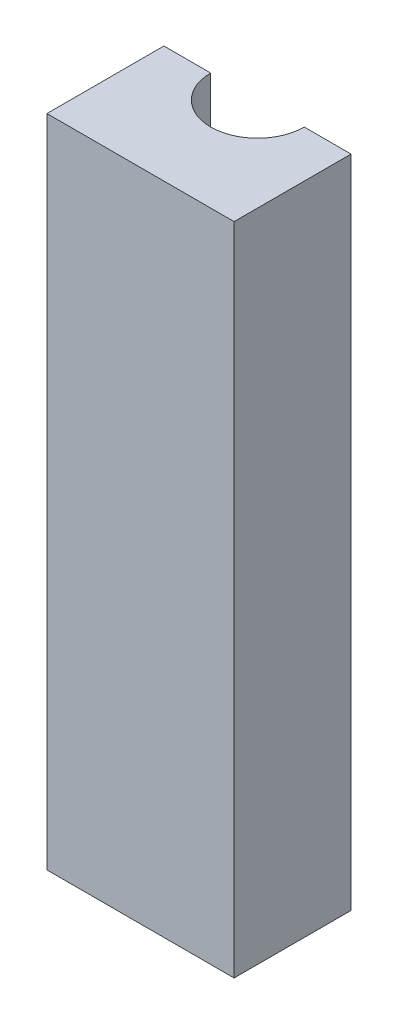
ISO-10303-21;
HEADER;
FILE_DESCRIPTION(('STEP AP214'),'2;1');
FILE_NAME('part.step','',(''),(''),'','','');
FILE_SCHEMA(('AUTOMOTIVE_DESIGN { 1 0 10303 214 1 1 1 1 }'));
ENDSEC;
DATA;
#1=APPLICATION_CONTEXT('core data for automotive mechanical design processes');
#2=APPLICATION_PROTOCOL_DEFINITION('international standard','automotive_design',2000,#1);
#3=PRODUCT_CONTEXT('',#1,'mechanical');
#4=PRODUCT('Part','Part','',(#3));
#5=PRODUCT_RELATED_PRODUCT_CATEGORY('part','',(#4));
#6=PRODUCT_DEFINITION_FORMATION('','',#4);
#7=PRODUCT_DEFINITION_CONTEXT('part definition',#1,'design');
#8=PRODUCT_DEFINITION('design','',#6,#7);
#9=PRODUCT_DEFINITION_SHAPE('','',#8);
#10=(LENGTH_UNIT() NAMED_UNIT(*) SI_UNIT(.MILLI.,.METRE.));
#11=(NAMED_UNIT(*) PLANE_ANGLE_UNIT() SI_UNIT($,.RADIAN.));
#12=(NAMED_UNIT(*) SI_UNIT($,.STERADIAN.) SOLID_ANGLE_UNIT());
#13=UNCERTAINTY_MEASURE_WITH_UNIT(LENGTH_MEASURE(1.E-05),#10,'distance_accuracy_value','');
#14=(GEOMETRIC_REPRESENTATION_CONTEXT(3) GLOBAL_UNCERTAINTY_ASSIGNED_CONTEXT((#13)) GLOBAL_UNIT_ASSIGNED_CONTEXT((#10,
#11,#12)) REPRESENTATION_CONTEXT('',''));
#15=CARTESIAN_POINT('',(0.,0.,0.));
#16=DIRECTION('',(0.,0.,1.));
#17=DIRECTION('',(1.,0.,0.));
#18=AXIS2_PLACEMENT_3D('',#15,#16,#17);
#19=CARTESIAN_POINT('',(0.,-140.,0.));
#20=DIRECTION('',(0.,1.,0.));
#21=DIRECTION('',(0.,0.,1.));
#22=AXIS2_PLACEMENT_3D('',#19,#20,#21);
#23=CYLINDRICAL_SURFACE('',#22,10.);
#24=CARTESIAN_POINT('',(0.,0.,0.));
#25=DIRECTION('',(0.,1.,0.));
#26=DIRECTION('',(0.,0.,1.));
#27=AXIS2_PLACEMENT_3D('',#24,#25,#26);
#28=CIRCLE('',#27,10.);
#29=CARTESIAN_POINT('',(-10.,0.,0.));
#30=VERTEX_POINT('',#29);
#31=CARTESIAN_POINT('',(10.,0.,0.));
#32=VERTEX_POINT('',#31);
#33=EDGE_CURVE('E138',#30,#32,#28,.T.);
#34=ORIENTED_EDGE('',*,*,#33,.T.);
#35=DIRECTION('',(0.,1.,0.));
#36=VECTOR('',#35,1.);
#37=CARTESIAN_POINT('',(10.,-140.,0.));
#38=LINE('',#37,#36);
#39=CARTESIAN_POINT('',(10.,-140.,0.));
#40=VERTEX_POINT('',#39);
#41=EDGE_CURVE('E11',#40,#32,#38,.T.);
#42=ORIENTED_EDGE('',*,*,#41,.F.);
#43=CARTESIAN_POINT('',(0.,-140.,0.));
#44=DIRECTION('',(0.,1.,0.));
#45=DIRECTION('',(0.,0.,1.));
#46=AXIS2_PLACEMENT_3D('',#43,#44,#45);
#47=CIRCLE('',#46,10.);
#48=CARTESIAN_POINT('',(-10.,-140.,0.));
#49=VERTEX_POINT('',#48);
#50=EDGE_CURVE('E62',#49,#40,#47,.T.);
#51=ORIENTED_EDGE('',*,*,#50,.F.);
#52=DIRECTION('',(0.,1.,0.));
#53=VECTOR('',#52,1.);
#54=CARTESIAN_POINT('',(-10.,-140.,0.));
#55=LINE('',#54,#53);
#56=EDGE_CURVE('E46',#49,#30,#55,.T.);
#57=ORIENTED_EDGE('',*,*,#56,.T.);
#58=EDGE_LOOP('',(#34,#42,#51,#57));
#59=FACE_BOUND('',#58,.T.);
#60=ADVANCED_FACE('F43',(#59),#23,.F.);
#61=CARTESIAN_POINT('',(0.,-140.,0.));
#62=DIRECTION('',(0.,0.,-1.));
#63=DIRECTION('',(-1.,0.,0.));
#64=AXIS2_PLACEMENT_3D('',#61,#62,#63);
#65=PLANE('',#64);
#66=DIRECTION('',(-1.,0.,0.));
#67=VECTOR('',#66,1.);
#68=CARTESIAN_POINT('',(0.,0.,0.));
#69=LINE('',#68,#67);
#70=CARTESIAN_POINT('',(20.,0.,0.));
#71=VERTEX_POINT('',#70);
#72=EDGE_CURVE('E154',#71,#32,#69,.T.);
#73=ORIENTED_EDGE('',*,*,#72,.F.);
#74=DIRECTION('',(0.,1.,0.));
#75=VECTOR('',#74,1.);
#76=CARTESIAN_POINT('',(20.,-140.,0.));
#77=LINE('',#76,#75);
#78=CARTESIAN_POINT('',(20.,-140.,0.));
#79=VERTEX_POINT('',#78);
#80=EDGE_CURVE('E53',#79,#71,#77,.T.);
#81=ORIENTED_EDGE('',*,*,#80,.F.);
#82=DIRECTION('',(-1.,0.,0.));
#83=VECTOR('',#82,1.);
#84=CARTESIAN_POINT('',(0.,-140.,0.));
#85=LINE('',#84,#83);
#86=EDGE_CURVE('E124',#79,#40,#85,.T.);
#87=ORIENTED_EDGE('',*,*,#86,.T.);
#88=ORIENTED_EDGE('',*,*,#41,.T.);
#89=EDGE_LOOP('',(#73,#81,#87,#88));
#90=FACE_BOUND('',#89,.T.);
#91=ADVANCED_FACE('F180',(#90),#65,.T.);
#92=CARTESIAN_POINT('',(20.,-140.,0.));
#93=DIRECTION('',(1.,0.,0.));
#94=DIRECTION('',(0.,0.,-1.));
#95=AXIS2_PLACEMENT_3D('',#92,#93,#94);
#96=PLANE('',#95);
#97=DIRECTION('',(0.,0.,-1.));
#98=VECTOR('',#97,1.);
#99=CARTESIAN_POINT('',(20.,0.,0.));
#100=LINE('',#99,#98);
#101=CARTESIAN_POINT('',(20.,0.,25.));
#102=VERTEX_POINT('',#101);
#103=EDGE_CURVE('E111',#102,#71,#100,.T.);
#104=ORIENTED_EDGE('',*,*,#103,.F.);
#105=DIRECTION('',(0.,1.,0.));
#106=VECTOR('',#105,1.);
#107=CARTESIAN_POINT('',(20.,-140.,25.));
#108=LINE('',#107,#106);
#109=CARTESIAN_POINT('',(20.,-140.,25.));
#110=VERTEX_POINT('',#109);
#111=EDGE_CURVE('E107',#110,#102,#108,.T.);
#112=ORIENTED_EDGE('',*,*,#111,.F.);
#113=DIRECTION('',(0.,0.,-1.));
#114=VECTOR('',#113,1.);
#115=CARTESIAN_POINT('',(20.,-140.,0.));
#116=LINE('',#115,#114);
#117=EDGE_CURVE('E110',#110,#79,#116,.T.);
#118=ORIENTED_EDGE('',*,*,#117,.T.);
#119=ORIENTED_EDGE('',*,*,#80,.T.);
#120=EDGE_LOOP('',(#104,#112,#118,#119));
#121=FACE_BOUND('',#120,.T.);
#122=ADVANCED_FACE('F109',(#121),#96,.T.);
#123=CARTESIAN_POINT('',(0.,-140.,25.));
#124=DIRECTION('',(0.,0.,1.));
#125=DIRECTION('',(1.,0.,0.));
#126=AXIS2_PLACEMENT_3D('',#123,#124,#125);
#127=PLANE('',#126);
#128=DIRECTION('',(1.,0.,0.));
#129=VECTOR('',#128,1.);
#130=CARTESIAN_POINT('',(0.,0.,25.));
#131=LINE('',#130,#129);
#132=CARTESIAN_POINT('',(-20.,0.,25.));
#133=VERTEX_POINT('',#132);
#134=EDGE_CURVE('E149',#133,#102,#131,.T.);
#135=ORIENTED_EDGE('',*,*,#134,.F.);
#136=DIRECTION('',(0.,1.,0.));
#137=VECTOR('',#136,1.);
#138=CARTESIAN_POINT('',(-20.,-140.,25.));
#139=LINE('',#138,#137);
#140=CARTESIAN_POINT('',(-20.,-140.,25.));
#141=VERTEX_POINT('',#140);
#142=EDGE_CURVE('E117',#141,#133,#139,.T.);
#143=ORIENTED_EDGE('',*,*,#142,.F.);
#144=DIRECTION('',(1.,0.,0.));
#145=VECTOR('',#144,1.);
#146=CARTESIAN_POINT('',(0.,-140.,25.));
#147=LINE('',#146,#145);
#148=EDGE_CURVE('E122',#141,#110,#147,.T.);
#149=ORIENTED_EDGE('',*,*,#148,.T.);
#150=ORIENTED_EDGE('',*,*,#111,.T.);
#151=EDGE_LOOP('',(#135,#143,#149,#150));
#152=FACE_BOUND('',#151,.T.);
#153=ADVANCED_FACE('F127',(#152),#127,.T.);
#154=CARTESIAN_POINT('',(-20.,-140.,0.));
#155=DIRECTION('',(-1.,0.,0.));
#156=DIRECTION('',(0.,0.,1.));
#157=AXIS2_PLACEMENT_3D('',#154,#155,#156);
#158=PLANE('',#157);
#159=DIRECTION('',(0.,0.,1.));
#160=VECTOR('',#159,1.);
#161=CARTESIAN_POINT('',(-20.,0.,0.));
#162=LINE('',#161,#160);
#163=CARTESIAN_POINT('',(-20.,0.,0.));
#164=VERTEX_POINT('',#163);
#165=EDGE_CURVE('E145',#164,#133,#162,.T.);
#166=ORIENTED_EDGE('',*,*,#165,.F.);
#167=DIRECTION('',(0.,1.,0.));
#168=VECTOR('',#167,1.);
#169=CARTESIAN_POINT('',(-20.,-140.,0.));
#170=LINE('',#169,#168);
#171=CARTESIAN_POINT('',(-20.,-140.,0.));
#172=VERTEX_POINT('',#171);
#173=EDGE_CURVE('E161',#172,#164,#170,.T.);
#174=ORIENTED_EDGE('',*,*,#173,.F.);
#175=DIRECTION('',(0.,0.,1.));
#176=VECTOR('',#175,1.);
#177=CARTESIAN_POINT('',(-20.,-140.,0.));
#178=LINE('',#177,#176);
#179=EDGE_CURVE('E129',#172,#141,#178,.T.);
#180=ORIENTED_EDGE('',*,*,#179,.T.);
#181=ORIENTED_EDGE('',*,*,#142,.T.);
#182=EDGE_LOOP('',(#166,#174,#180,#181));
#183=FACE_BOUND('',#182,.T.);
#184=ADVANCED_FACE('F171',(#183),#158,.T.);
#185=CARTESIAN_POINT('',(0.,-140.,0.));
#186=DIRECTION('',(0.,0.,-1.));
#187=DIRECTION('',(-1.,0.,0.));
#188=AXIS2_PLACEMENT_3D('',#185,#186,#187);
#189=PLANE('',#188);
#190=DIRECTION('',(-1.,0.,0.));
#191=VECTOR('',#190,1.);
#192=CARTESIAN_POINT('',(0.,0.,0.));
#193=LINE('',#192,#191);
#194=EDGE_CURVE('E141',#30,#164,#193,.T.);
#195=ORIENTED_EDGE('',*,*,#194,.F.);
#196=ORIENTED_EDGE('',*,*,#56,.F.);
#197=DIRECTION('',(-1.,0.,0.));
#198=VECTOR('',#197,1.);
#199=CARTESIAN_POINT('',(0.,-140.,0.));
#200=LINE('',#199,#198);
#201=EDGE_CURVE('E132',#49,#172,#200,.T.);
#202=ORIENTED_EDGE('',*,*,#201,.T.);
#203=ORIENTED_EDGE('',*,*,#173,.T.);
#204=EDGE_LOOP('',(#195,#196,#202,#203));
#205=FACE_BOUND('',#204,.T.);
#206=ADVANCED_FACE('F169',(#205),#189,.T.);
#207=CARTESIAN_POINT('',(0.,-140.,0.));
#208=DIRECTION('',(0.,1.,0.));
#209=DIRECTION('',(0.,0.,1.));
#210=AXIS2_PLACEMENT_3D('',#207,#208,#209);
#211=PLANE('',#210);
#212=ORIENTED_EDGE('',*,*,#50,.T.);
#213=ORIENTED_EDGE('',*,*,#86,.F.);
#214=ORIENTED_EDGE('',*,*,#117,.F.);
#215=ORIENTED_EDGE('',*,*,#148,.F.);
#216=ORIENTED_EDGE('',*,*,#179,.F.);
#217=ORIENTED_EDGE('',*,*,#201,.F.);
#218=EDGE_LOOP('',(#212,#213,#214,#215,#216,#217));
#219=FACE_BOUND('',#218,.T.);
#220=ADVANCED_FACE('F120',(#219),#211,.F.);
#221=CARTESIAN_POINT('',(0.,0.,0.));
#222=DIRECTION('',(0.,1.,0.));
#223=DIRECTION('',(0.,0.,1.));
#224=AXIS2_PLACEMENT_3D('',#221,#222,#223);
#225=PLANE('',#224);
#226=ORIENTED_EDGE('',*,*,#33,.F.);
#227=ORIENTED_EDGE('',*,*,#194,.T.);
#228=ORIENTED_EDGE('',*,*,#165,.T.);
#229=ORIENTED_EDGE('',*,*,#134,.T.);
#230=ORIENTED_EDGE('',*,*,#103,.T.);
#231=ORIENTED_EDGE('',*,*,#72,.T.);
#232=EDGE_LOOP('',(#226,#227,#228,#229,#230,#231));
#233=FACE_BOUND('',#232,.T.);
#234=ADVANCED_FACE('F168',(#233),#225,.T.);
#235=CLOSED_SHELL('',(#60,#91,#122,#153,#184,#206,#220,#234));
#236=MANIFOLD_SOLID_BREP('B2',#235);
#237=ADVANCED_BREP_SHAPE_REPRESENTATION('',(#18,#236),#14);
#238=SHAPE_DEFINITION_REPRESENTATION(#9,#237);
ENDSEC;
END-ISO-10303-21;
